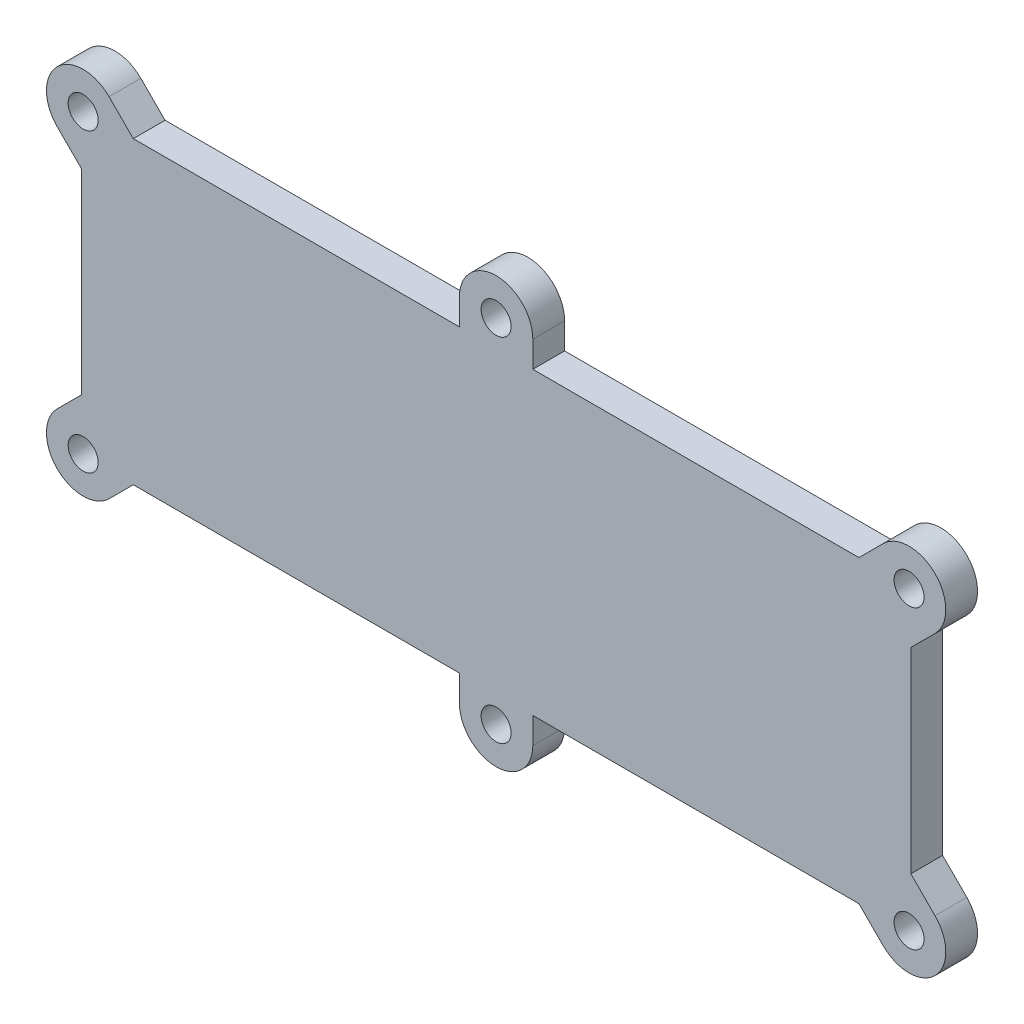
ISO-10303-21;
HEADER;
FILE_DESCRIPTION(('STEP AP214'),'2;1');
FILE_NAME('part.step','',(''),(''),'','','');
FILE_SCHEMA(('AUTOMOTIVE_DESIGN { 1 0 10303 214 1 1 1 1 }'));
ENDSEC;
DATA;
#1=APPLICATION_CONTEXT('core data for automotive mechanical design processes');
#2=APPLICATION_PROTOCOL_DEFINITION('international standard','automotive_design',2000,#1);
#3=PRODUCT_CONTEXT('',#1,'mechanical');
#4=PRODUCT('Part','Part','',(#3));
#5=PRODUCT_RELATED_PRODUCT_CATEGORY('part','',(#4));
#6=PRODUCT_DEFINITION_FORMATION('','',#4);
#7=PRODUCT_DEFINITION_CONTEXT('part definition',#1,'design');
#8=PRODUCT_DEFINITION('design','',#6,#7);
#9=PRODUCT_DEFINITION_SHAPE('','',#8);
#10=(LENGTH_UNIT() NAMED_UNIT(*) SI_UNIT(.MILLI.,.METRE.));
#11=(NAMED_UNIT(*) PLANE_ANGLE_UNIT() SI_UNIT($,.RADIAN.));
#12=(NAMED_UNIT(*) SI_UNIT($,.STERADIAN.) SOLID_ANGLE_UNIT());
#13=UNCERTAINTY_MEASURE_WITH_UNIT(LENGTH_MEASURE(1.E-05),#10,'distance_accuracy_value','');
#14=(GEOMETRIC_REPRESENTATION_CONTEXT(3) GLOBAL_UNCERTAINTY_ASSIGNED_CONTEXT((#13)) GLOBAL_UNIT_ASSIGNED_CONTEXT((#10,
#11,#12)) REPRESENTATION_CONTEXT('',''));
#15=CARTESIAN_POINT('',(0.,0.,0.));
#16=DIRECTION('',(0.,0.,1.));
#17=DIRECTION('',(1.,0.,0.));
#18=AXIS2_PLACEMENT_3D('',#15,#16,#17);
#19=CARTESIAN_POINT('',(169.737535958449,-39.7250258147976,4.7625));
#20=DIRECTION('',(0.707106781186552,-0.707106781186543,0.));
#21=DIRECTION('',(0.707106781186543,0.707106781186552,0.));
#22=AXIS2_PLACEMENT_3D('',#19,#20,#21);
#23=PLANE('',#22);
#24=DIRECTION('',(-0.707106781186543,-0.707106781186552,0.));
#25=VECTOR('',#24,1.);
#26=CARTESIAN_POINT('',(169.737535958449,-39.7250258147976,0.));
#27=LINE('',#26,#25);
#28=CARTESIAN_POINT('',(169.737535958449,-39.7250258147976,0.));
#29=VERTEX_POINT('',#28);
#30=CARTESIAN_POINT('',(166.110631802736,-43.3519299705105,0.));
#31=VERTEX_POINT('',#30);
#32=EDGE_CURVE('E230',#29,#31,#27,.T.);
#33=ORIENTED_EDGE('',*,*,#32,.T.);
#34=DIRECTION('',(0.,0.,-1.));
#35=VECTOR('',#34,1.);
#36=CARTESIAN_POINT('',(166.110631802736,-43.3519299705105,4.7625));
#37=LINE('',#36,#35);
#38=CARTESIAN_POINT('',(166.110631802736,-43.3519299705105,4.7625));
#39=VERTEX_POINT('',#38);
#40=EDGE_CURVE('E11',#39,#31,#37,.T.);
#41=ORIENTED_EDGE('',*,*,#40,.F.);
#42=DIRECTION('',(-0.707106781186543,-0.707106781186552,0.));
#43=VECTOR('',#42,1.);
#44=CARTESIAN_POINT('',(169.737535958449,-39.7250258147976,4.7625));
#45=LINE('',#44,#43);
#46=CARTESIAN_POINT('',(169.737535958449,-39.7250258147976,4.7625));
#47=VERTEX_POINT('',#46);
#48=EDGE_CURVE('E277',#47,#39,#45,.T.);
#49=ORIENTED_EDGE('',*,*,#48,.F.);
#50=DIRECTION('',(0.,0.,-1.));
#51=VECTOR('',#50,1.);
#52=CARTESIAN_POINT('',(169.737535958449,-39.7250258147976,4.7625));
#53=LINE('',#52,#51);
#54=EDGE_CURVE('E226',#47,#29,#53,.T.);
#55=ORIENTED_EDGE('',*,*,#54,.T.);
#56=EDGE_LOOP('',(#33,#41,#49,#55));
#57=FACE_BOUND('',#56,.T.);
#58=ADVANCED_FACE('F38',(#57),#23,.F.);
#59=CARTESIAN_POINT('',(166.110631802736,-43.3519299705105,4.7625));
#60=DIRECTION('',(0.,-1.,0.));
#61=DIRECTION('',(0.,0.,-1.));
#62=AXIS2_PLACEMENT_3D('',#59,#60,#61);
#63=PLANE('',#62);
#64=DIRECTION('',(-1.,0.,0.));
#65=VECTOR('',#64,1.);
#66=CARTESIAN_POINT('',(166.110631802736,-43.3519299705105,0.));
#67=LINE('',#66,#65);
#68=CARTESIAN_POINT('',(117.238806395788,-43.3519299705105,0.));
#69=VERTEX_POINT('',#68);
#70=EDGE_CURVE('E233',#31,#69,#67,.T.);
#71=ORIENTED_EDGE('',*,*,#70,.T.);
#72=DIRECTION('',(0.,0.,-1.));
#73=VECTOR('',#72,1.);
#74=CARTESIAN_POINT('',(117.238806395788,-43.3519299705105,4.7625));
#75=LINE('',#74,#73);
#76=CARTESIAN_POINT('',(117.238806395788,-43.3519299705105,4.7625));
#77=VERTEX_POINT('',#76);
#78=EDGE_CURVE('E46',#77,#69,#75,.T.);
#79=ORIENTED_EDGE('',*,*,#78,.F.);
#80=DIRECTION('',(-1.,0.,0.));
#81=VECTOR('',#80,1.);
#82=CARTESIAN_POINT('',(166.110631802736,-43.3519299705105,4.7625));
#83=LINE('',#82,#81);
#84=EDGE_CURVE('E145',#39,#77,#83,.T.);
#85=ORIENTED_EDGE('',*,*,#84,.F.);
#86=ORIENTED_EDGE('',*,*,#40,.T.);
#87=EDGE_LOOP('',(#71,#79,#85,#86));
#88=FACE_BOUND('',#87,.T.);
#89=ADVANCED_FACE('F416',(#88),#63,.F.);
#90=CARTESIAN_POINT('',(117.238806395788,-43.3519299705105,4.7625));
#91=DIRECTION('',(-1.,0.,0.));
#92=DIRECTION('',(0.,0.,1.));
#93=AXIS2_PLACEMENT_3D('',#90,#91,#92);
#94=PLANE('',#93);
#95=DIRECTION('',(0.,1.,0.));
#96=VECTOR('',#95,1.);
#97=CARTESIAN_POINT('',(117.238806395788,-43.3519299705105,0.));
#98=LINE('',#97,#96);
#99=CARTESIAN_POINT('',(117.238806395788,-39.4422299705105,0.));
#100=VERTEX_POINT('',#99);
#101=EDGE_CURVE('E236',#69,#100,#98,.T.);
#102=ORIENTED_EDGE('',*,*,#101,.T.);
#103=DIRECTION('',(0.,0.,-1.));
#104=VECTOR('',#103,1.);
#105=CARTESIAN_POINT('',(117.238806395788,-39.4422299705105,4.7625));
#106=LINE('',#105,#104);
#107=CARTESIAN_POINT('',(117.238806395788,-39.4422299705105,4.7625));
#108=VERTEX_POINT('',#107);
#109=EDGE_CURVE('E332',#108,#100,#106,.T.);
#110=ORIENTED_EDGE('',*,*,#109,.F.);
#111=DIRECTION('',(0.,1.,0.));
#112=VECTOR('',#111,1.);
#113=CARTESIAN_POINT('',(117.238806395788,-43.3519299705105,4.7625));
#114=LINE('',#113,#112);
#115=EDGE_CURVE('E340',#77,#108,#114,.T.);
#116=ORIENTED_EDGE('',*,*,#115,.F.);
#117=ORIENTED_EDGE('',*,*,#78,.T.);
#118=EDGE_LOOP('',(#102,#110,#116,#117));
#119=FACE_BOUND('',#118,.T.);
#120=ADVANCED_FACE('F338',(#119),#94,.F.);
#121=CARTESIAN_POINT('',(111.738806395788,-39.4422299705105,4.7625));
#122=DIRECTION('',(0.,0.,-1.));
#123=DIRECTION('',(-1.,0.,0.));
#124=AXIS2_PLACEMENT_3D('',#121,#122,#123);
#125=CYLINDRICAL_SURFACE('',#124,5.50000000000001);
#126=CARTESIAN_POINT('',(111.738806395788,-39.4422299705105,0.));
#127=DIRECTION('',(0.,0.,1.));
#128=DIRECTION('',(1.,0.,0.));
#129=AXIS2_PLACEMENT_3D('',#126,#127,#128);
#130=CIRCLE('',#129,5.50000000000001);
#131=CARTESIAN_POINT('',(106.238806395788,-39.4422299705105,0.));
#132=VERTEX_POINT('',#131);
#133=EDGE_CURVE('E238',#100,#132,#130,.T.);
#134=ORIENTED_EDGE('',*,*,#133,.T.);
#135=DIRECTION('',(0.,0.,-1.));
#136=VECTOR('',#135,1.);
#137=CARTESIAN_POINT('',(106.238806395788,-39.4422299705105,4.7625));
#138=LINE('',#137,#136);
#139=CARTESIAN_POINT('',(106.238806395788,-39.4422299705105,4.7625));
#140=VERTEX_POINT('',#139);
#141=EDGE_CURVE('E329',#140,#132,#138,.T.);
#142=ORIENTED_EDGE('',*,*,#141,.F.);
#143=CARTESIAN_POINT('',(111.738806395788,-39.4422299705105,4.7625));
#144=DIRECTION('',(0.,0.,1.));
#145=DIRECTION('',(1.,0.,0.));
#146=AXIS2_PLACEMENT_3D('',#143,#144,#145);
#147=CIRCLE('',#146,5.50000000000001);
#148=EDGE_CURVE('E358',#108,#140,#147,.T.);
#149=ORIENTED_EDGE('',*,*,#148,.F.);
#150=ORIENTED_EDGE('',*,*,#109,.T.);
#151=EDGE_LOOP('',(#134,#142,#149,#150));
#152=FACE_BOUND('',#151,.T.);
#153=ADVANCED_FACE('F349',(#152),#125,.T.);
#154=CARTESIAN_POINT('',(106.238806395788,-39.4422299705105,4.7625));
#155=DIRECTION('',(1.,0.,0.));
#156=DIRECTION('',(0.,0.,-1.));
#157=AXIS2_PLACEMENT_3D('',#154,#155,#156);
#158=PLANE('',#157);
#159=DIRECTION('',(0.,-1.,0.));
#160=VECTOR('',#159,1.);
#161=CARTESIAN_POINT('',(106.238806395788,-39.4422299705105,0.));
#162=LINE('',#161,#160);
#163=CARTESIAN_POINT('',(106.238806395788,-43.3519299705105,0.));
#164=VERTEX_POINT('',#163);
#165=EDGE_CURVE('E240',#132,#164,#162,.T.);
#166=ORIENTED_EDGE('',*,*,#165,.T.);
#167=DIRECTION('',(0.,0.,-1.));
#168=VECTOR('',#167,1.);
#169=CARTESIAN_POINT('',(106.238806395788,-43.3519299705105,4.7625));
#170=LINE('',#169,#168);
#171=CARTESIAN_POINT('',(106.238806395788,-43.3519299705105,4.7625));
#172=VERTEX_POINT('',#171);
#173=EDGE_CURVE('E326',#172,#164,#170,.T.);
#174=ORIENTED_EDGE('',*,*,#173,.F.);
#175=DIRECTION('',(0.,-1.,0.));
#176=VECTOR('',#175,1.);
#177=CARTESIAN_POINT('',(106.238806395788,-39.4422299705105,4.7625));
#178=LINE('',#177,#176);
#179=EDGE_CURVE('E355',#140,#172,#178,.T.);
#180=ORIENTED_EDGE('',*,*,#179,.F.);
#181=ORIENTED_EDGE('',*,*,#141,.T.);
#182=EDGE_LOOP('',(#166,#174,#180,#181));
#183=FACE_BOUND('',#182,.T.);
#184=ADVANCED_FACE('F353',(#183),#158,.F.);
#185=CARTESIAN_POINT('',(106.238806395788,-43.3519299705105,4.7625));
#186=DIRECTION('',(0.,-1.,0.));
#187=DIRECTION('',(0.,0.,-1.));
#188=AXIS2_PLACEMENT_3D('',#185,#186,#187);
#189=PLANE('',#188);
#190=DIRECTION('',(-1.,0.,0.));
#191=VECTOR('',#190,1.);
#192=CARTESIAN_POINT('',(106.238806395788,-43.3519299705105,0.));
#193=LINE('',#192,#191);
#194=CARTESIAN_POINT('',(57.3669809888401,-43.3519299705105,0.));
#195=VERTEX_POINT('',#194);
#196=EDGE_CURVE('E242',#164,#195,#193,.T.);
#197=ORIENTED_EDGE('',*,*,#196,.T.);
#198=DIRECTION('',(0.,0.,-1.));
#199=VECTOR('',#198,1.);
#200=CARTESIAN_POINT('',(57.3669809888401,-43.3519299705105,4.7625));
#201=LINE('',#200,#199);
#202=CARTESIAN_POINT('',(57.3669809888401,-43.3519299705105,4.7625));
#203=VERTEX_POINT('',#202);
#204=EDGE_CURVE('E323',#203,#195,#201,.T.);
#205=ORIENTED_EDGE('',*,*,#204,.F.);
#206=DIRECTION('',(-1.,0.,0.));
#207=VECTOR('',#206,1.);
#208=CARTESIAN_POINT('',(106.238806395788,-43.3519299705105,4.7625));
#209=LINE('',#208,#207);
#210=EDGE_CURVE('E357',#172,#203,#209,.T.);
#211=ORIENTED_EDGE('',*,*,#210,.F.);
#212=ORIENTED_EDGE('',*,*,#173,.T.);
#213=EDGE_LOOP('',(#197,#205,#211,#212));
#214=FACE_BOUND('',#213,.T.);
#215=ADVANCED_FACE('F429',(#214),#189,.F.);
#216=CARTESIAN_POINT('',(57.3669809888401,-43.3519299705105,4.7625));
#217=DIRECTION('',(-0.707106781186548,-0.707106781186548,0.));
#218=DIRECTION('',(0.707106781186548,-0.707106781186548,0.));
#219=AXIS2_PLACEMENT_3D('',#216,#217,#218);
#220=PLANE('',#219);
#221=DIRECTION('',(-0.707106781186548,0.707106781186548,0.));
#222=VECTOR('',#221,1.);
#223=CARTESIAN_POINT('',(57.3669809888401,-43.3519299705105,0.));
#224=LINE('',#223,#222);
#225=CARTESIAN_POINT('',(53.7400768331272,-39.7250258147976,0.));
#226=VERTEX_POINT('',#225);
#227=EDGE_CURVE('E244',#195,#226,#224,.T.);
#228=ORIENTED_EDGE('',*,*,#227,.T.);
#229=DIRECTION('',(0.,0.,-1.));
#230=VECTOR('',#229,1.);
#231=CARTESIAN_POINT('',(53.7400768331272,-39.7250258147976,4.7625));
#232=LINE('',#231,#230);
#233=CARTESIAN_POINT('',(53.7400768331272,-39.7250258147976,4.7625));
#234=VERTEX_POINT('',#233);
#235=EDGE_CURVE('E320',#234,#226,#232,.T.);
#236=ORIENTED_EDGE('',*,*,#235,.F.);
#237=DIRECTION('',(-0.707106781186548,0.707106781186548,0.));
#238=VECTOR('',#237,1.);
#239=CARTESIAN_POINT('',(57.3669809888401,-43.3519299705105,4.7625));
#240=LINE('',#239,#238);
#241=EDGE_CURVE('E360',#203,#234,#240,.T.);
#242=ORIENTED_EDGE('',*,*,#241,.F.);
#243=ORIENTED_EDGE('',*,*,#204,.T.);
#244=EDGE_LOOP('',(#228,#236,#242,#243));
#245=FACE_BOUND('',#244,.T.);
#246=ADVANCED_FACE('F432',(#245),#220,.F.);
#247=CARTESIAN_POINT('',(49.8509895366012,-43.6141131113236,4.7625));
#248=DIRECTION('',(0.,0.,-1.));
#249=DIRECTION('',(-1.,0.,0.));
#250=AXIS2_PLACEMENT_3D('',#247,#248,#249);
#251=CYLINDRICAL_SURFACE('',#250,5.49999999999999);
#252=CARTESIAN_POINT('',(49.8509895366012,-43.6141131113236,0.));
#253=DIRECTION('',(0.,0.,1.));
#254=DIRECTION('',(1.,0.,0.));
#255=AXIS2_PLACEMENT_3D('',#252,#253,#254);
#256=CIRCLE('',#255,5.49999999999999);
#257=CARTESIAN_POINT('',(45.9619022400752,-47.5032004078496,0.));
#258=VERTEX_POINT('',#257);
#259=EDGE_CURVE('E246',#226,#258,#256,.T.);
#260=ORIENTED_EDGE('',*,*,#259,.T.);
#261=DIRECTION('',(0.,0.,-1.));
#262=VECTOR('',#261,1.);
#263=CARTESIAN_POINT('',(45.9619022400752,-47.5032004078496,4.7625));
#264=LINE('',#263,#262);
#265=CARTESIAN_POINT('',(45.9619022400752,-47.5032004078496,4.7625));
#266=VERTEX_POINT('',#265);
#267=EDGE_CURVE('E317',#266,#258,#264,.T.);
#268=ORIENTED_EDGE('',*,*,#267,.F.);
#269=CARTESIAN_POINT('',(49.8509895366012,-43.6141131113236,4.7625));
#270=DIRECTION('',(0.,0.,1.));
#271=DIRECTION('',(1.,0.,0.));
#272=AXIS2_PLACEMENT_3D('',#269,#270,#271);
#273=CIRCLE('',#272,5.49999999999999);
#274=EDGE_CURVE('E366',#234,#266,#273,.T.);
#275=ORIENTED_EDGE('',*,*,#274,.F.);
#276=ORIENTED_EDGE('',*,*,#235,.T.);
#277=EDGE_LOOP('',(#260,#268,#275,#276));
#278=FACE_BOUND('',#277,.T.);
#279=ADVANCED_FACE('F436',(#278),#251,.T.);
#280=CARTESIAN_POINT('',(45.9619022400752,-47.5032004078497,4.7625));
#281=DIRECTION('',(0.707106781186549,0.707106781186545,0.));
#282=DIRECTION('',(-0.707106781186546,0.70710678118655,0.));
#283=AXIS2_PLACEMENT_3D('',#280,#281,#282);
#284=PLANE('',#283);
#285=DIRECTION('',(0.707106781186545,-0.707106781186549,0.));
#286=VECTOR('',#285,1.);
#287=CARTESIAN_POINT('',(45.9619022400752,-47.5032004078497,0.));
#288=LINE('',#287,#286);
#289=CARTESIAN_POINT('',(49.588806395788,-51.1301045635625,0.));
#290=VERTEX_POINT('',#289);
#291=EDGE_CURVE('E248',#258,#290,#288,.T.);
#292=ORIENTED_EDGE('',*,*,#291,.T.);
#293=DIRECTION('',(0.,0.,-1.));
#294=VECTOR('',#293,1.);
#295=CARTESIAN_POINT('',(49.588806395788,-51.1301045635625,4.7625));
#296=LINE('',#295,#294);
#297=CARTESIAN_POINT('',(49.588806395788,-51.1301045635625,4.7625));
#298=VERTEX_POINT('',#297);
#299=EDGE_CURVE('E314',#298,#290,#296,.T.);
#300=ORIENTED_EDGE('',*,*,#299,.F.);
#301=DIRECTION('',(0.707106781186545,-0.707106781186549,0.));
#302=VECTOR('',#301,1.);
#303=CARTESIAN_POINT('',(45.9619022400752,-47.5032004078497,4.7625));
#304=LINE('',#303,#302);
#305=EDGE_CURVE('E368',#266,#298,#304,.T.);
#306=ORIENTED_EDGE('',*,*,#305,.F.);
#307=ORIENTED_EDGE('',*,*,#267,.T.);
#308=EDGE_LOOP('',(#292,#300,#306,#307));
#309=FACE_BOUND('',#308,.T.);
#310=ADVANCED_FACE('F440',(#309),#284,.F.);
#311=CARTESIAN_POINT('',(49.588806395788,-51.1301045635625,4.7625));
#312=DIRECTION('',(1.,0.,0.));
#313=DIRECTION('',(0.,0.,-1.));
#314=AXIS2_PLACEMENT_3D('',#311,#312,#313);
#315=PLANE('',#314);
#316=DIRECTION('',(0.,-1.,0.));
#317=VECTOR('',#316,1.);
#318=CARTESIAN_POINT('',(49.588806395788,-51.1301045635625,0.));
#319=LINE('',#318,#317);
#320=CARTESIAN_POINT('',(49.588806395788,-80.4987553774585,0.));
#321=VERTEX_POINT('',#320);
#322=EDGE_CURVE('E250',#290,#321,#319,.T.);
#323=ORIENTED_EDGE('',*,*,#322,.T.);
#324=DIRECTION('',(0.,0.,-1.));
#325=VECTOR('',#324,1.);
#326=CARTESIAN_POINT('',(49.588806395788,-80.4987553774585,4.7625));
#327=LINE('',#326,#325);
#328=CARTESIAN_POINT('',(49.588806395788,-80.4987553774585,4.7625));
#329=VERTEX_POINT('',#328);
#330=EDGE_CURVE('E311',#329,#321,#327,.T.);
#331=ORIENTED_EDGE('',*,*,#330,.F.);
#332=DIRECTION('',(0.,-1.,0.));
#333=VECTOR('',#332,1.);
#334=CARTESIAN_POINT('',(49.588806395788,-51.1301045635625,4.7625));
#335=LINE('',#334,#333);
#336=EDGE_CURVE('E370',#298,#329,#335,.T.);
#337=ORIENTED_EDGE('',*,*,#336,.F.);
#338=ORIENTED_EDGE('',*,*,#299,.T.);
#339=EDGE_LOOP('',(#323,#331,#337,#338));
#340=FACE_BOUND('',#339,.T.);
#341=ADVANCED_FACE('F444',(#340),#315,.F.);
#342=CARTESIAN_POINT('',(49.588806395788,-80.4987553774585,4.7625));
#343=DIRECTION('',(0.707106781186546,-0.707106781186549,0.));
#344=DIRECTION('',(0.707106781186549,0.707106781186546,0.));
#345=AXIS2_PLACEMENT_3D('',#342,#343,#344);
#346=PLANE('',#345);
#347=DIRECTION('',(-0.707106781186549,-0.707106781186546,0.));
#348=VECTOR('',#347,1.);
#349=CARTESIAN_POINT('',(49.588806395788,-80.4987553774585,0.));
#350=LINE('',#349,#348);
#351=CARTESIAN_POINT('',(45.9619022400752,-84.1256595331713,0.));
#352=VERTEX_POINT('',#351);
#353=EDGE_CURVE('E252',#321,#352,#350,.T.);
#354=ORIENTED_EDGE('',*,*,#353,.T.);
#355=DIRECTION('',(0.,0.,-1.));
#356=VECTOR('',#355,1.);
#357=CARTESIAN_POINT('',(45.9619022400752,-84.1256595331713,4.7625));
#358=LINE('',#357,#356);
#359=CARTESIAN_POINT('',(45.9619022400752,-84.1256595331713,4.7625));
#360=VERTEX_POINT('',#359);
#361=EDGE_CURVE('E308',#360,#352,#358,.T.);
#362=ORIENTED_EDGE('',*,*,#361,.F.);
#363=DIRECTION('',(-0.707106781186549,-0.707106781186546,0.));
#364=VECTOR('',#363,1.);
#365=CARTESIAN_POINT('',(49.588806395788,-80.4987553774585,4.7625));
#366=LINE('',#365,#364);
#367=EDGE_CURVE('E372',#329,#360,#366,.T.);
#368=ORIENTED_EDGE('',*,*,#367,.F.);
#369=ORIENTED_EDGE('',*,*,#330,.T.);
#370=EDGE_LOOP('',(#354,#362,#368,#369));
#371=FACE_BOUND('',#370,.T.);
#372=ADVANCED_FACE('F448',(#371),#346,.F.);
#373=CARTESIAN_POINT('',(49.8509895366012,-88.0147468296973,4.7625));
#374=DIRECTION('',(0.,0.,-1.));
#375=DIRECTION('',(-1.,0.,0.));
#376=AXIS2_PLACEMENT_3D('',#373,#374,#375);
#377=CYLINDRICAL_SURFACE('',#376,5.50000000000001);
#378=CARTESIAN_POINT('',(49.8509895366012,-88.0147468296973,0.));
#379=DIRECTION('',(0.,0.,1.));
#380=DIRECTION('',(1.,0.,0.));
#381=AXIS2_PLACEMENT_3D('',#378,#379,#380);
#382=CIRCLE('',#381,5.50000000000001);
#383=CARTESIAN_POINT('',(53.7400768331272,-91.9038341262234,0.));
#384=VERTEX_POINT('',#383);
#385=EDGE_CURVE('E254',#352,#384,#382,.T.);
#386=ORIENTED_EDGE('',*,*,#385,.T.);
#387=DIRECTION('',(0.,0.,-1.));
#388=VECTOR('',#387,1.);
#389=CARTESIAN_POINT('',(53.7400768331272,-91.9038341262234,4.7625));
#390=LINE('',#389,#388);
#391=CARTESIAN_POINT('',(53.7400768331272,-91.9038341262234,4.7625));
#392=VERTEX_POINT('',#391);
#393=EDGE_CURVE('E305',#392,#384,#390,.T.);
#394=ORIENTED_EDGE('',*,*,#393,.F.);
#395=CARTESIAN_POINT('',(49.8509895366012,-88.0147468296973,4.7625));
#396=DIRECTION('',(0.,0.,1.));
#397=DIRECTION('',(1.,0.,0.));
#398=AXIS2_PLACEMENT_3D('',#395,#396,#397);
#399=CIRCLE('',#398,5.50000000000001);
#400=EDGE_CURVE('E374',#360,#392,#399,.T.);
#401=ORIENTED_EDGE('',*,*,#400,.F.);
#402=ORIENTED_EDGE('',*,*,#361,.T.);
#403=EDGE_LOOP('',(#386,#394,#401,#402));
#404=FACE_BOUND('',#403,.T.);
#405=ADVANCED_FACE('F452',(#404),#377,.T.);
#406=CARTESIAN_POINT('',(53.7400768331272,-91.9038341262233,4.7625));
#407=DIRECTION('',(-0.707106781186549,0.707106781186545,0.));
#408=DIRECTION('',(-0.707106781186546,-0.70710678118655,0.));
#409=AXIS2_PLACEMENT_3D('',#406,#407,#408);
#410=PLANE('',#409);
#411=DIRECTION('',(0.707106781186545,0.707106781186549,0.));
#412=VECTOR('',#411,1.);
#413=CARTESIAN_POINT('',(53.7400768331272,-91.9038341262233,0.));
#414=LINE('',#413,#412);
#415=CARTESIAN_POINT('',(57.3669809888401,-88.2769299705105,0.));
#416=VERTEX_POINT('',#415);
#417=EDGE_CURVE('E256',#384,#416,#414,.T.);
#418=ORIENTED_EDGE('',*,*,#417,.T.);
#419=DIRECTION('',(0.,0.,-1.));
#420=VECTOR('',#419,1.);
#421=CARTESIAN_POINT('',(57.3669809888401,-88.2769299705105,4.7625));
#422=LINE('',#421,#420);
#423=CARTESIAN_POINT('',(57.3669809888401,-88.2769299705105,4.7625));
#424=VERTEX_POINT('',#423);
#425=EDGE_CURVE('E302',#424,#416,#422,.T.);
#426=ORIENTED_EDGE('',*,*,#425,.F.);
#427=DIRECTION('',(0.707106781186545,0.707106781186549,0.));
#428=VECTOR('',#427,1.);
#429=CARTESIAN_POINT('',(53.7400768331272,-91.9038341262233,4.7625));
#430=LINE('',#429,#428);
#431=EDGE_CURVE('E376',#392,#424,#430,.T.);
#432=ORIENTED_EDGE('',*,*,#431,.F.);
#433=ORIENTED_EDGE('',*,*,#393,.T.);
#434=EDGE_LOOP('',(#418,#426,#432,#433));
#435=FACE_BOUND('',#434,.T.);
#436=ADVANCED_FACE('F456',(#435),#410,.F.);
#437=CARTESIAN_POINT('',(57.3669809888401,-88.2769299705105,4.7625));
#438=DIRECTION('',(0.,1.,0.));
#439=DIRECTION('',(0.,0.,1.));
#440=AXIS2_PLACEMENT_3D('',#437,#438,#439);
#441=PLANE('',#440);
#442=DIRECTION('',(1.,0.,0.));
#443=VECTOR('',#442,1.);
#444=CARTESIAN_POINT('',(57.3669809888401,-88.2769299705105,0.));
#445=LINE('',#444,#443);
#446=CARTESIAN_POINT('',(106.238806395788,-88.2769299705105,0.));
#447=VERTEX_POINT('',#446);
#448=EDGE_CURVE('E258',#416,#447,#445,.T.);
#449=ORIENTED_EDGE('',*,*,#448,.T.);
#450=DIRECTION('',(0.,0.,-1.));
#451=VECTOR('',#450,1.);
#452=CARTESIAN_POINT('',(106.238806395788,-88.2769299705105,4.7625));
#453=LINE('',#452,#451);
#454=CARTESIAN_POINT('',(106.238806395788,-88.2769299705105,4.7625));
#455=VERTEX_POINT('',#454);
#456=EDGE_CURVE('E299',#455,#447,#453,.T.);
#457=ORIENTED_EDGE('',*,*,#456,.F.);
#458=DIRECTION('',(1.,0.,0.));
#459=VECTOR('',#458,1.);
#460=CARTESIAN_POINT('',(57.3669809888401,-88.2769299705105,4.7625));
#461=LINE('',#460,#459);
#462=EDGE_CURVE('E378',#424,#455,#461,.T.);
#463=ORIENTED_EDGE('',*,*,#462,.F.);
#464=ORIENTED_EDGE('',*,*,#425,.T.);
#465=EDGE_LOOP('',(#449,#457,#463,#464));
#466=FACE_BOUND('',#465,.T.);
#467=ADVANCED_FACE('F460',(#466),#441,.F.);
#468=CARTESIAN_POINT('',(106.238806395788,-88.2769299705105,4.7625));
#469=DIRECTION('',(1.,0.,0.));
#470=DIRECTION('',(0.,0.,-1.));
#471=AXIS2_PLACEMENT_3D('',#468,#469,#470);
#472=PLANE('',#471);
#473=DIRECTION('',(0.,-1.,0.));
#474=VECTOR('',#473,1.);
#475=CARTESIAN_POINT('',(106.238806395788,-88.2769299705105,0.));
#476=LINE('',#475,#474);
#477=CARTESIAN_POINT('',(106.238806395788,-92.1866299705105,0.));
#478=VERTEX_POINT('',#477);
#479=EDGE_CURVE('E260',#447,#478,#476,.T.);
#480=ORIENTED_EDGE('',*,*,#479,.T.);
#481=DIRECTION('',(0.,0.,-1.));
#482=VECTOR('',#481,1.);
#483=CARTESIAN_POINT('',(106.238806395788,-92.1866299705105,4.7625));
#484=LINE('',#483,#482);
#485=CARTESIAN_POINT('',(106.238806395788,-92.1866299705105,4.7625));
#486=VERTEX_POINT('',#485);
#487=EDGE_CURVE('E296',#486,#478,#484,.T.);
#488=ORIENTED_EDGE('',*,*,#487,.F.);
#489=DIRECTION('',(0.,-1.,0.));
#490=VECTOR('',#489,1.);
#491=CARTESIAN_POINT('',(106.238806395788,-88.2769299705105,4.7625));
#492=LINE('',#491,#490);
#493=EDGE_CURVE('E380',#455,#486,#492,.T.);
#494=ORIENTED_EDGE('',*,*,#493,.F.);
#495=ORIENTED_EDGE('',*,*,#456,.T.);
#496=EDGE_LOOP('',(#480,#488,#494,#495));
#497=FACE_BOUND('',#496,.T.);
#498=ADVANCED_FACE('F464',(#497),#472,.F.);
#499=CARTESIAN_POINT('',(111.738806395788,-92.1866299705105,4.7625));
#500=DIRECTION('',(0.,0.,-1.));
#501=DIRECTION('',(-1.,0.,0.));
#502=AXIS2_PLACEMENT_3D('',#499,#500,#501);
#503=CYLINDRICAL_SURFACE('',#502,5.50000000000001);
#504=CARTESIAN_POINT('',(111.738806395788,-92.1866299705105,0.));
#505=DIRECTION('',(0.,0.,1.));
#506=DIRECTION('',(1.,0.,0.));
#507=AXIS2_PLACEMENT_3D('',#504,#505,#506);
#508=CIRCLE('',#507,5.50000000000001);
#509=CARTESIAN_POINT('',(117.238806395788,-92.1866299705105,0.));
#510=VERTEX_POINT('',#509);
#511=EDGE_CURVE('E262',#478,#510,#508,.T.);
#512=ORIENTED_EDGE('',*,*,#511,.T.);
#513=DIRECTION('',(0.,0.,-1.));
#514=VECTOR('',#513,1.);
#515=CARTESIAN_POINT('',(117.238806395788,-92.1866299705105,4.7625));
#516=LINE('',#515,#514);
#517=CARTESIAN_POINT('',(117.238806395788,-92.1866299705105,4.7625));
#518=VERTEX_POINT('',#517);
#519=EDGE_CURVE('E293',#518,#510,#516,.T.);
#520=ORIENTED_EDGE('',*,*,#519,.F.);
#521=CARTESIAN_POINT('',(111.738806395788,-92.1866299705105,4.7625));
#522=DIRECTION('',(0.,0.,1.));
#523=DIRECTION('',(1.,0.,0.));
#524=AXIS2_PLACEMENT_3D('',#521,#522,#523);
#525=CIRCLE('',#524,5.50000000000001);
#526=EDGE_CURVE('E382',#486,#518,#525,.T.);
#527=ORIENTED_EDGE('',*,*,#526,.F.);
#528=ORIENTED_EDGE('',*,*,#487,.T.);
#529=EDGE_LOOP('',(#512,#520,#527,#528));
#530=FACE_BOUND('',#529,.T.);
#531=ADVANCED_FACE('F468',(#530),#503,.T.);
#532=CARTESIAN_POINT('',(117.238806395788,-92.1866299705105,4.7625));
#533=DIRECTION('',(-1.,0.,0.));
#534=DIRECTION('',(0.,0.,1.));
#535=AXIS2_PLACEMENT_3D('',#532,#533,#534);
#536=PLANE('',#535);
#537=DIRECTION('',(0.,1.,0.));
#538=VECTOR('',#537,1.);
#539=CARTESIAN_POINT('',(117.238806395788,-92.1866299705105,0.));
#540=LINE('',#539,#538);
#541=CARTESIAN_POINT('',(117.238806395788,-88.2769299705105,0.));
#542=VERTEX_POINT('',#541);
#543=EDGE_CURVE('E264',#510,#542,#540,.T.);
#544=ORIENTED_EDGE('',*,*,#543,.T.);
#545=DIRECTION('',(0.,0.,-1.));
#546=VECTOR('',#545,1.);
#547=CARTESIAN_POINT('',(117.238806395788,-88.2769299705105,4.7625));
#548=LINE('',#547,#546);
#549=CARTESIAN_POINT('',(117.238806395788,-88.2769299705105,4.7625));
#550=VERTEX_POINT('',#549);
#551=EDGE_CURVE('E290',#550,#542,#548,.T.);
#552=ORIENTED_EDGE('',*,*,#551,.F.);
#553=DIRECTION('',(0.,1.,0.));
#554=VECTOR('',#553,1.);
#555=CARTESIAN_POINT('',(117.238806395788,-92.1866299705105,4.7625));
#556=LINE('',#555,#554);
#557=EDGE_CURVE('E384',#518,#550,#556,.T.);
#558=ORIENTED_EDGE('',*,*,#557,.F.);
#559=ORIENTED_EDGE('',*,*,#519,.T.);
#560=EDGE_LOOP('',(#544,#552,#558,#559));
#561=FACE_BOUND('',#560,.T.);
#562=ADVANCED_FACE('F472',(#561),#536,.F.);
#563=CARTESIAN_POINT('',(117.238806395788,-88.2769299705105,4.7625));
#564=DIRECTION('',(0.,1.,0.));
#565=DIRECTION('',(0.,0.,1.));
#566=AXIS2_PLACEMENT_3D('',#563,#564,#565);
#567=PLANE('',#566);
#568=DIRECTION('',(1.,0.,0.));
#569=VECTOR('',#568,1.);
#570=CARTESIAN_POINT('',(117.238806395788,-88.2769299705105,0.));
#571=LINE('',#570,#569);
#572=CARTESIAN_POINT('',(166.110631802736,-88.2769299705105,0.));
#573=VERTEX_POINT('',#572);
#574=EDGE_CURVE('E266',#542,#573,#571,.T.);
#575=ORIENTED_EDGE('',*,*,#574,.T.);
#576=DIRECTION('',(0.,0.,-1.));
#577=VECTOR('',#576,1.);
#578=CARTESIAN_POINT('',(166.110631802736,-88.2769299705105,4.7625));
#579=LINE('',#578,#577);
#580=CARTESIAN_POINT('',(166.110631802736,-88.2769299705105,4.7625));
#581=VERTEX_POINT('',#580);
#582=EDGE_CURVE('E287',#581,#573,#579,.T.);
#583=ORIENTED_EDGE('',*,*,#582,.F.);
#584=DIRECTION('',(1.,0.,0.));
#585=VECTOR('',#584,1.);
#586=CARTESIAN_POINT('',(117.238806395788,-88.2769299705105,4.7625));
#587=LINE('',#586,#585);
#588=EDGE_CURVE('E386',#550,#581,#587,.T.);
#589=ORIENTED_EDGE('',*,*,#588,.F.);
#590=ORIENTED_EDGE('',*,*,#551,.T.);
#591=EDGE_LOOP('',(#575,#583,#589,#590));
#592=FACE_BOUND('',#591,.T.);
#593=ADVANCED_FACE('F476',(#592),#567,.F.);
#594=CARTESIAN_POINT('',(166.110631802736,-88.2769299705105,4.7625));
#595=DIRECTION('',(0.707106781186547,0.707106781186547,0.));
#596=DIRECTION('',(-0.707106781186548,0.707106781186548,0.));
#597=AXIS2_PLACEMENT_3D('',#594,#595,#596);
#598=PLANE('',#597);
#599=DIRECTION('',(0.707106781186547,-0.707106781186547,0.));
#600=VECTOR('',#599,1.);
#601=CARTESIAN_POINT('',(166.110631802736,-88.2769299705105,0.));
#602=LINE('',#601,#600);
#603=CARTESIAN_POINT('',(169.737535958449,-91.9038341262233,0.));
#604=VERTEX_POINT('',#603);
#605=EDGE_CURVE('E268',#573,#604,#602,.T.);
#606=ORIENTED_EDGE('',*,*,#605,.T.);
#607=DIRECTION('',(0.,0.,-1.));
#608=VECTOR('',#607,1.);
#609=CARTESIAN_POINT('',(169.737535958449,-91.9038341262233,4.7625));
#610=LINE('',#609,#608);
#611=CARTESIAN_POINT('',(169.737535958449,-91.9038341262233,4.7625));
#612=VERTEX_POINT('',#611);
#613=EDGE_CURVE('E284',#612,#604,#610,.T.);
#614=ORIENTED_EDGE('',*,*,#613,.F.);
#615=DIRECTION('',(0.707106781186547,-0.707106781186547,0.));
#616=VECTOR('',#615,1.);
#617=CARTESIAN_POINT('',(166.110631802736,-88.2769299705105,4.7625));
#618=LINE('',#617,#616);
#619=EDGE_CURVE('E388',#581,#612,#618,.T.);
#620=ORIENTED_EDGE('',*,*,#619,.F.);
#621=ORIENTED_EDGE('',*,*,#582,.T.);
#622=EDGE_LOOP('',(#606,#614,#620,#621));
#623=FACE_BOUND('',#622,.T.);
#624=ADVANCED_FACE('F480',(#623),#598,.F.);
#625=CARTESIAN_POINT('',(173.626623254975,-88.0147468296973,4.7625));
#626=DIRECTION('',(0.,0.,-1.));
#627=DIRECTION('',(-1.,0.,0.));
#628=AXIS2_PLACEMENT_3D('',#625,#626,#627);
#629=CYLINDRICAL_SURFACE('',#628,5.49999999999998);
#630=CARTESIAN_POINT('',(173.626623254975,-88.0147468296973,0.));
#631=DIRECTION('',(0.,0.,1.));
#632=DIRECTION('',(1.,0.,0.));
#633=AXIS2_PLACEMENT_3D('',#630,#631,#632);
#634=CIRCLE('',#633,5.49999999999998);
#635=CARTESIAN_POINT('',(177.515710551501,-84.1256595331713,0.));
#636=VERTEX_POINT('',#635);
#637=EDGE_CURVE('E270',#604,#636,#634,.T.);
#638=ORIENTED_EDGE('',*,*,#637,.T.);
#639=DIRECTION('',(0.,0.,-1.));
#640=VECTOR('',#639,1.);
#641=CARTESIAN_POINT('',(177.515710551501,-84.1256595331713,4.7625));
#642=LINE('',#641,#640);
#643=CARTESIAN_POINT('',(177.515710551501,-84.1256595331713,4.7625));
#644=VERTEX_POINT('',#643);
#645=EDGE_CURVE('E281',#644,#636,#642,.T.);
#646=ORIENTED_EDGE('',*,*,#645,.F.);
#647=CARTESIAN_POINT('',(173.626623254975,-88.0147468296973,4.7625));
#648=DIRECTION('',(0.,0.,1.));
#649=DIRECTION('',(1.,0.,0.));
#650=AXIS2_PLACEMENT_3D('',#647,#648,#649);
#651=CIRCLE('',#650,5.49999999999998);
#652=EDGE_CURVE('E390',#612,#644,#651,.T.);
#653=ORIENTED_EDGE('',*,*,#652,.F.);
#654=ORIENTED_EDGE('',*,*,#613,.T.);
#655=EDGE_LOOP('',(#638,#646,#653,#654));
#656=FACE_BOUND('',#655,.T.);
#657=ADVANCED_FACE('F396',(#656),#629,.T.);
#658=CARTESIAN_POINT('',(177.515710551501,-84.1256595331713,4.7625));
#659=DIRECTION('',(-0.707106781186552,-0.707106781186543,0.));
#660=DIRECTION('',(0.707106781186543,-0.707106781186552,0.));
#661=AXIS2_PLACEMENT_3D('',#658,#659,#660);
#662=PLANE('',#661);
#663=DIRECTION('',(-0.707106781186543,0.707106781186552,0.));
#664=VECTOR('',#663,1.);
#665=CARTESIAN_POINT('',(177.515710551501,-84.1256595331713,0.));
#666=LINE('',#665,#664);
#667=CARTESIAN_POINT('',(173.888806395788,-80.4987553774585,0.));
#668=VERTEX_POINT('',#667);
#669=EDGE_CURVE('E272',#636,#668,#666,.T.);
#670=ORIENTED_EDGE('',*,*,#669,.T.);
#671=DIRECTION('',(0.,0.,-1.));
#672=VECTOR('',#671,1.);
#673=CARTESIAN_POINT('',(173.888806395788,-80.4987553774585,4.7625));
#674=LINE('',#673,#672);
#675=CARTESIAN_POINT('',(173.888806395788,-80.4987553774585,4.7625));
#676=VERTEX_POINT('',#675);
#677=EDGE_CURVE('E221',#676,#668,#674,.T.);
#678=ORIENTED_EDGE('',*,*,#677,.F.);
#679=DIRECTION('',(-0.707106781186543,0.707106781186552,0.));
#680=VECTOR('',#679,1.);
#681=CARTESIAN_POINT('',(177.515710551501,-84.1256595331713,4.7625));
#682=LINE('',#681,#680);
#683=EDGE_CURVE('E212',#644,#676,#682,.T.);
#684=ORIENTED_EDGE('',*,*,#683,.F.);
#685=ORIENTED_EDGE('',*,*,#645,.T.);
#686=EDGE_LOOP('',(#670,#678,#684,#685));
#687=FACE_BOUND('',#686,.T.);
#688=ADVANCED_FACE('F400',(#687),#662,.F.);
#689=CARTESIAN_POINT('',(173.888806395788,-80.4987553774585,4.7625));
#690=DIRECTION('',(-1.,0.,0.));
#691=DIRECTION('',(0.,0.,1.));
#692=AXIS2_PLACEMENT_3D('',#689,#690,#691);
#693=PLANE('',#692);
#694=DIRECTION('',(0.,1.,0.));
#695=VECTOR('',#694,1.);
#696=CARTESIAN_POINT('',(173.888806395788,-80.4987553774585,0.));
#697=LINE('',#696,#695);
#698=CARTESIAN_POINT('',(173.888806395788,-51.1301045635625,0.));
#699=VERTEX_POINT('',#698);
#700=EDGE_CURVE('E220',#668,#699,#697,.T.);
#701=ORIENTED_EDGE('',*,*,#700,.T.);
#702=DIRECTION('',(0.,0.,-1.));
#703=VECTOR('',#702,1.);
#704=CARTESIAN_POINT('',(173.888806395788,-51.1301045635625,4.7625));
#705=LINE('',#704,#703);
#706=CARTESIAN_POINT('',(173.888806395788,-51.1301045635625,4.7625));
#707=VERTEX_POINT('',#706);
#708=EDGE_CURVE('E217',#707,#699,#705,.T.);
#709=ORIENTED_EDGE('',*,*,#708,.F.);
#710=DIRECTION('',(0.,1.,0.));
#711=VECTOR('',#710,1.);
#712=CARTESIAN_POINT('',(173.888806395788,-80.4987553774585,4.7625));
#713=LINE('',#712,#711);
#714=EDGE_CURVE('E206',#676,#707,#713,.T.);
#715=ORIENTED_EDGE('',*,*,#714,.F.);
#716=ORIENTED_EDGE('',*,*,#677,.T.);
#717=EDGE_LOOP('',(#701,#709,#715,#716));
#718=FACE_BOUND('',#717,.T.);
#719=ADVANCED_FACE('F218',(#718),#693,.F.);
#720=CARTESIAN_POINT('',(173.888806395788,-51.1301045635625,4.7625));
#721=DIRECTION('',(-0.707106781186547,0.707106781186548,0.));
#722=DIRECTION('',(-0.707106781186548,-0.707106781186547,0.));
#723=AXIS2_PLACEMENT_3D('',#720,#721,#722);
#724=PLANE('',#723);
#725=DIRECTION('',(0.707106781186548,0.707106781186547,0.));
#726=VECTOR('',#725,1.);
#727=CARTESIAN_POINT('',(173.888806395788,-51.1301045635625,0.));
#728=LINE('',#727,#726);
#729=CARTESIAN_POINT('',(177.515710551501,-47.5032004078497,0.));
#730=VERTEX_POINT('',#729);
#731=EDGE_CURVE('E131',#699,#730,#728,.T.);
#732=ORIENTED_EDGE('',*,*,#731,.T.);
#733=DIRECTION('',(0.,0.,-1.));
#734=VECTOR('',#733,1.);
#735=CARTESIAN_POINT('',(177.515710551501,-47.5032004078497,4.7625));
#736=LINE('',#735,#734);
#737=CARTESIAN_POINT('',(177.515710551501,-47.5032004078497,4.7625));
#738=VERTEX_POINT('',#737);
#739=EDGE_CURVE('E222',#738,#730,#736,.T.);
#740=ORIENTED_EDGE('',*,*,#739,.F.);
#741=DIRECTION('',(0.707106781186548,0.707106781186547,0.));
#742=VECTOR('',#741,1.);
#743=CARTESIAN_POINT('',(173.888806395788,-51.1301045635625,4.7625));
#744=LINE('',#743,#742);
#745=EDGE_CURVE('E210',#707,#738,#744,.T.);
#746=ORIENTED_EDGE('',*,*,#745,.F.);
#747=ORIENTED_EDGE('',*,*,#708,.T.);
#748=EDGE_LOOP('',(#732,#740,#746,#747));
#749=FACE_BOUND('',#748,.T.);
#750=ADVANCED_FACE('F224',(#749),#724,.F.);
#751=CARTESIAN_POINT('',(173.626623254975,-43.6141131113236,4.7625));
#752=DIRECTION('',(0.,0.,-1.));
#753=DIRECTION('',(-1.,0.,0.));
#754=AXIS2_PLACEMENT_3D('',#751,#752,#753);
#755=CYLINDRICAL_SURFACE('',#754,5.50000000000002);
#756=CARTESIAN_POINT('',(173.626623254975,-43.6141131113236,0.));
#757=DIRECTION('',(0.,0.,1.));
#758=DIRECTION('',(1.,0.,0.));
#759=AXIS2_PLACEMENT_3D('',#756,#757,#758);
#760=CIRCLE('',#759,5.50000000000002);
#761=EDGE_CURVE('E137',#730,#29,#760,.T.);
#762=ORIENTED_EDGE('',*,*,#761,.T.);
#763=ORIENTED_EDGE('',*,*,#54,.F.);
#764=CARTESIAN_POINT('',(173.626623254975,-43.6141131113236,4.7625));
#765=DIRECTION('',(0.,0.,1.));
#766=DIRECTION('',(1.,0.,0.));
#767=AXIS2_PLACEMENT_3D('',#764,#765,#766);
#768=CIRCLE('',#767,5.50000000000002);
#769=EDGE_CURVE('E54',#738,#47,#768,.T.);
#770=ORIENTED_EDGE('',*,*,#769,.F.);
#771=ORIENTED_EDGE('',*,*,#739,.T.);
#772=EDGE_LOOP('',(#762,#763,#770,#771));
#773=FACE_BOUND('',#772,.T.);
#774=ADVANCED_FACE('F404',(#773),#755,.T.);
#775=CARTESIAN_POINT('',(111.738806395788,-39.4422299705105,4.7625));
#776=DIRECTION('',(0.,0.,1.));
#777=DIRECTION('',(1.,0.,0.));
#778=AXIS2_PLACEMENT_3D('',#775,#776,#777);
#779=PLANE('',#778);
#780=CARTESIAN_POINT('',(111.738806395788,-39.4422299705105,4.7625));
#781=DIRECTION('',(0.,0.,1.));
#782=DIRECTION('',(1.,0.,0.));
#783=AXIS2_PLACEMENT_3D('',#780,#781,#782);
#784=CIRCLE('',#783,2.24999999999999);
#785=CARTESIAN_POINT('',(113.988806395788,-39.4422299705105,4.7625));
#786=VERTEX_POINT('',#785);
#787=EDGE_CURVE('E586',#786,#786,#784,.T.);
#788=ORIENTED_EDGE('',*,*,#787,.F.);
#789=EDGE_LOOP('',(#788));
#790=FACE_BOUND('',#789,.T.);
#791=CARTESIAN_POINT('',(173.626623254975,-43.6141131113236,4.7625));
#792=DIRECTION('',(0.,0.,1.));
#793=DIRECTION('',(1.,0.,0.));
#794=AXIS2_PLACEMENT_3D('',#791,#792,#793);
#795=CIRCLE('',#794,2.24999999999997);
#796=CARTESIAN_POINT('',(175.876623254975,-43.6141131113236,4.7625));
#797=VERTEX_POINT('',#796);
#798=EDGE_CURVE('E588',#797,#797,#795,.T.);
#799=ORIENTED_EDGE('',*,*,#798,.F.);
#800=EDGE_LOOP('',(#799));
#801=FACE_BOUND('',#800,.T.);
#802=CARTESIAN_POINT('',(173.626623254975,-88.0147468296973,4.7625));
#803=DIRECTION('',(0.,0.,1.));
#804=DIRECTION('',(1.,0.,0.));
#805=AXIS2_PLACEMENT_3D('',#802,#803,#804);
#806=CIRCLE('',#805,2.24999999999997);
#807=CARTESIAN_POINT('',(175.876623254975,-88.0147468296973,4.7625));
#808=VERTEX_POINT('',#807);
#809=EDGE_CURVE('E596',#808,#808,#806,.T.);
#810=ORIENTED_EDGE('',*,*,#809,.F.);
#811=EDGE_LOOP('',(#810));
#812=FACE_BOUND('',#811,.T.);
#813=CARTESIAN_POINT('',(111.738806395788,-92.1866299705105,4.7625));
#814=DIRECTION('',(0.,0.,1.));
#815=DIRECTION('',(1.,0.,0.));
#816=AXIS2_PLACEMENT_3D('',#813,#814,#815);
#817=CIRCLE('',#816,2.24999999999999);
#818=CARTESIAN_POINT('',(113.988806395788,-92.1866299705105,4.7625));
#819=VERTEX_POINT('',#818);
#820=EDGE_CURVE('E602',#819,#819,#817,.T.);
#821=ORIENTED_EDGE('',*,*,#820,.F.);
#822=EDGE_LOOP('',(#821));
#823=FACE_BOUND('',#822,.T.);
#824=CARTESIAN_POINT('',(49.8509895366012,-88.0147468296973,4.7625));
#825=DIRECTION('',(0.,0.,1.));
#826=DIRECTION('',(1.,0.,0.));
#827=AXIS2_PLACEMENT_3D('',#824,#825,#826);
#828=CIRCLE('',#827,2.24999999999999);
#829=CARTESIAN_POINT('',(52.1009895366012,-88.0147468296973,4.7625));
#830=VERTEX_POINT('',#829);
#831=EDGE_CURVE('E608',#830,#830,#828,.T.);
#832=ORIENTED_EDGE('',*,*,#831,.F.);
#833=EDGE_LOOP('',(#832));
#834=FACE_BOUND('',#833,.T.);
#835=CARTESIAN_POINT('',(49.8509895366012,-43.6141131113236,4.7625));
#836=DIRECTION('',(0.,0.,1.));
#837=DIRECTION('',(1.,0.,0.));
#838=AXIS2_PLACEMENT_3D('',#835,#836,#837);
#839=CIRCLE('',#838,2.24999999999999);
#840=CARTESIAN_POINT('',(52.1009895366012,-43.6141131113236,4.7625));
#841=VERTEX_POINT('',#840);
#842=EDGE_CURVE('E614',#841,#841,#839,.T.);
#843=ORIENTED_EDGE('',*,*,#842,.F.);
#844=EDGE_LOOP('',(#843));
#845=FACE_BOUND('',#844,.T.);
#846=ORIENTED_EDGE('',*,*,#48,.T.);
#847=ORIENTED_EDGE('',*,*,#84,.T.);
#848=ORIENTED_EDGE('',*,*,#115,.T.);
#849=ORIENTED_EDGE('',*,*,#148,.T.);
#850=ORIENTED_EDGE('',*,*,#179,.T.);
#851=ORIENTED_EDGE('',*,*,#210,.T.);
#852=ORIENTED_EDGE('',*,*,#241,.T.);
#853=ORIENTED_EDGE('',*,*,#274,.T.);
#854=ORIENTED_EDGE('',*,*,#305,.T.);
#855=ORIENTED_EDGE('',*,*,#336,.T.);
#856=ORIENTED_EDGE('',*,*,#367,.T.);
#857=ORIENTED_EDGE('',*,*,#400,.T.);
#858=ORIENTED_EDGE('',*,*,#431,.T.);
#859=ORIENTED_EDGE('',*,*,#462,.T.);
#860=ORIENTED_EDGE('',*,*,#493,.T.);
#861=ORIENTED_EDGE('',*,*,#526,.T.);
#862=ORIENTED_EDGE('',*,*,#557,.T.);
#863=ORIENTED_EDGE('',*,*,#588,.T.);
#864=ORIENTED_EDGE('',*,*,#619,.T.);
#865=ORIENTED_EDGE('',*,*,#652,.T.);
#866=ORIENTED_EDGE('',*,*,#683,.T.);
#867=ORIENTED_EDGE('',*,*,#714,.T.);
#868=ORIENTED_EDGE('',*,*,#745,.T.);
#869=ORIENTED_EDGE('',*,*,#769,.T.);
#870=EDGE_LOOP('',(#846,#847,#848,#849,#850,#851,#852,#853,#854,#855,#856,#857,#858,#859,#860,
#861,#862,#863,#864,#865,#866,#867,#868,#869));
#871=FACE_BOUND('',#870,.T.);
#872=ADVANCED_FACE('F208',(#790,#801,#812,#823,#834,#845,#871),#779,.T.);
#873=CARTESIAN_POINT('',(111.738806395788,-39.4422299705105,0.));
#874=DIRECTION('',(0.,0.,1.));
#875=DIRECTION('',(1.,0.,0.));
#876=AXIS2_PLACEMENT_3D('',#873,#874,#875);
#877=PLANE('',#876);
#878=CARTESIAN_POINT('',(111.738806395788,-39.4422299705105,0.));
#879=DIRECTION('',(0.,0.,1.));
#880=DIRECTION('',(1.,0.,0.));
#881=AXIS2_PLACEMENT_3D('',#878,#879,#880);
#882=CIRCLE('',#881,2.25);
#883=CARTESIAN_POINT('',(113.988806395788,-39.4422299705105,0.));
#884=VERTEX_POINT('',#883);
#885=EDGE_CURVE('E583',#884,#884,#882,.T.);
#886=ORIENTED_EDGE('',*,*,#885,.T.);
#887=EDGE_LOOP('',(#886));
#888=FACE_BOUND('',#887,.T.);
#889=CARTESIAN_POINT('',(173.626623254975,-43.6141131113236,0.));
#890=DIRECTION('',(0.,0.,1.));
#891=DIRECTION('',(1.,0.,0.));
#892=AXIS2_PLACEMENT_3D('',#889,#890,#891);
#893=CIRCLE('',#892,2.25);
#894=CARTESIAN_POINT('',(175.876623254975,-43.6141131113236,0.));
#895=VERTEX_POINT('',#894);
#896=EDGE_CURVE('E593',#895,#895,#893,.T.);
#897=ORIENTED_EDGE('',*,*,#896,.T.);
#898=EDGE_LOOP('',(#897));
#899=FACE_BOUND('',#898,.T.);
#900=CARTESIAN_POINT('',(173.626623254975,-88.0147468296973,0.));
#901=DIRECTION('',(0.,0.,1.));
#902=DIRECTION('',(1.,0.,0.));
#903=AXIS2_PLACEMENT_3D('',#900,#901,#902);
#904=CIRCLE('',#903,2.25);
#905=CARTESIAN_POINT('',(175.876623254975,-88.0147468296973,0.));
#906=VERTEX_POINT('',#905);
#907=EDGE_CURVE('E599',#906,#906,#904,.T.);
#908=ORIENTED_EDGE('',*,*,#907,.T.);
#909=EDGE_LOOP('',(#908));
#910=FACE_BOUND('',#909,.T.);
#911=CARTESIAN_POINT('',(111.738806395788,-92.1866299705105,0.));
#912=DIRECTION('',(0.,0.,1.));
#913=DIRECTION('',(1.,0.,0.));
#914=AXIS2_PLACEMENT_3D('',#911,#912,#913);
#915=CIRCLE('',#914,2.25);
#916=CARTESIAN_POINT('',(113.988806395788,-92.1866299705105,0.));
#917=VERTEX_POINT('',#916);
#918=EDGE_CURVE('E605',#917,#917,#915,.T.);
#919=ORIENTED_EDGE('',*,*,#918,.T.);
#920=EDGE_LOOP('',(#919));
#921=FACE_BOUND('',#920,.T.);
#922=CARTESIAN_POINT('',(49.8509895366012,-88.0147468296973,0.));
#923=DIRECTION('',(0.,0.,1.));
#924=DIRECTION('',(1.,0.,0.));
#925=AXIS2_PLACEMENT_3D('',#922,#923,#924);
#926=CIRCLE('',#925,2.25);
#927=CARTESIAN_POINT('',(52.1009895366012,-88.0147468296973,0.));
#928=VERTEX_POINT('',#927);
#929=EDGE_CURVE('E611',#928,#928,#926,.T.);
#930=ORIENTED_EDGE('',*,*,#929,.T.);
#931=EDGE_LOOP('',(#930));
#932=FACE_BOUND('',#931,.T.);
#933=CARTESIAN_POINT('',(49.8509895366012,-43.6141131113236,0.));
#934=DIRECTION('',(0.,0.,1.));
#935=DIRECTION('',(1.,0.,0.));
#936=AXIS2_PLACEMENT_3D('',#933,#934,#935);
#937=CIRCLE('',#936,2.25);
#938=CARTESIAN_POINT('',(52.1009895366012,-43.6141131113236,0.));
#939=VERTEX_POINT('',#938);
#940=EDGE_CURVE('E234',#939,#939,#937,.T.);
#941=ORIENTED_EDGE('',*,*,#940,.T.);
#942=EDGE_LOOP('',(#941));
#943=FACE_BOUND('',#942,.T.);
#944=ORIENTED_EDGE('',*,*,#32,.F.);
#945=ORIENTED_EDGE('',*,*,#761,.F.);
#946=ORIENTED_EDGE('',*,*,#731,.F.);
#947=ORIENTED_EDGE('',*,*,#700,.F.);
#948=ORIENTED_EDGE('',*,*,#669,.F.);
#949=ORIENTED_EDGE('',*,*,#637,.F.);
#950=ORIENTED_EDGE('',*,*,#605,.F.);
#951=ORIENTED_EDGE('',*,*,#574,.F.);
#952=ORIENTED_EDGE('',*,*,#543,.F.);
#953=ORIENTED_EDGE('',*,*,#511,.F.);
#954=ORIENTED_EDGE('',*,*,#479,.F.);
#955=ORIENTED_EDGE('',*,*,#448,.F.);
#956=ORIENTED_EDGE('',*,*,#417,.F.);
#957=ORIENTED_EDGE('',*,*,#385,.F.);
#958=ORIENTED_EDGE('',*,*,#353,.F.);
#959=ORIENTED_EDGE('',*,*,#322,.F.);
#960=ORIENTED_EDGE('',*,*,#291,.F.);
#961=ORIENTED_EDGE('',*,*,#259,.F.);
#962=ORIENTED_EDGE('',*,*,#227,.F.);
#963=ORIENTED_EDGE('',*,*,#196,.F.);
#964=ORIENTED_EDGE('',*,*,#165,.F.);
#965=ORIENTED_EDGE('',*,*,#133,.F.);
#966=ORIENTED_EDGE('',*,*,#101,.F.);
#967=ORIENTED_EDGE('',*,*,#70,.F.);
#968=EDGE_LOOP('',(#944,#945,#946,#947,#948,#949,#950,#951,#952,#953,#954,#955,#956,#957,#958,
#959,#960,#961,#962,#963,#964,#965,#966,#967));
#969=FACE_BOUND('',#968,.T.);
#970=ADVANCED_FACE('F344',(#888,#899,#910,#921,#932,#943,#969),#877,.F.);
#971=CARTESIAN_POINT('',(49.8509895366012,-43.6141131113236,4.7625));
#972=DIRECTION('',(0.,0.,1.));
#973=DIRECTION('',(1.,0.,0.));
#974=AXIS2_PLACEMENT_3D('',#971,#972,#973);
#975=CYLINDRICAL_SURFACE('',#974,2.25);
#976=ORIENTED_EDGE('',*,*,#940,.F.);
#977=EDGE_LOOP('',(#976));
#978=FACE_BOUND('',#977,.T.);
#979=ORIENTED_EDGE('',*,*,#842,.T.);
#980=EDGE_LOOP('',(#979));
#981=FACE_BOUND('',#980,.T.);
#982=ADVANCED_FACE('F517',(#978,#981),#975,.F.);
#983=CARTESIAN_POINT('',(49.8509895366012,-88.0147468296973,4.7625));
#984=DIRECTION('',(0.,0.,1.));
#985=DIRECTION('',(1.,0.,0.));
#986=AXIS2_PLACEMENT_3D('',#983,#984,#985);
#987=CYLINDRICAL_SURFACE('',#986,2.25);
#988=ORIENTED_EDGE('',*,*,#929,.F.);
#989=EDGE_LOOP('',(#988));
#990=FACE_BOUND('',#989,.T.);
#991=ORIENTED_EDGE('',*,*,#831,.T.);
#992=EDGE_LOOP('',(#991));
#993=FACE_BOUND('',#992,.T.);
#994=ADVANCED_FACE('F526',(#990,#993),#987,.F.);
#995=CARTESIAN_POINT('',(111.738806395788,-92.1866299705105,4.7625));
#996=DIRECTION('',(0.,0.,1.));
#997=DIRECTION('',(1.,0.,0.));
#998=AXIS2_PLACEMENT_3D('',#995,#996,#997);
#999=CYLINDRICAL_SURFACE('',#998,2.25);
#1000=ORIENTED_EDGE('',*,*,#918,.F.);
#1001=EDGE_LOOP('',(#1000));
#1002=FACE_BOUND('',#1001,.T.);
#1003=ORIENTED_EDGE('',*,*,#820,.T.);
#1004=EDGE_LOOP('',(#1003));
#1005=FACE_BOUND('',#1004,.T.);
#1006=ADVANCED_FACE('F536',(#1002,#1005),#999,.F.);
#1007=CARTESIAN_POINT('',(173.626623254975,-88.0147468296973,4.7625));
#1008=DIRECTION('',(0.,0.,1.));
#1009=DIRECTION('',(1.,0.,0.));
#1010=AXIS2_PLACEMENT_3D('',#1007,#1008,#1009);
#1011=CYLINDRICAL_SURFACE('',#1010,2.24999999999999);
#1012=ORIENTED_EDGE('',*,*,#907,.F.);
#1013=EDGE_LOOP('',(#1012));
#1014=FACE_BOUND('',#1013,.T.);
#1015=ORIENTED_EDGE('',*,*,#809,.T.);
#1016=EDGE_LOOP('',(#1015));
#1017=FACE_BOUND('',#1016,.T.);
#1018=ADVANCED_FACE('F546',(#1014,#1017),#1011,.F.);
#1019=CARTESIAN_POINT('',(173.626623254975,-43.6141131113236,4.7625));
#1020=DIRECTION('',(0.,0.,1.));
#1021=DIRECTION('',(1.,0.,0.));
#1022=AXIS2_PLACEMENT_3D('',#1019,#1020,#1021);
#1023=CYLINDRICAL_SURFACE('',#1022,2.24999999999999);
#1024=ORIENTED_EDGE('',*,*,#896,.F.);
#1025=EDGE_LOOP('',(#1024));
#1026=FACE_BOUND('',#1025,.T.);
#1027=ORIENTED_EDGE('',*,*,#798,.T.);
#1028=EDGE_LOOP('',(#1027));
#1029=FACE_BOUND('',#1028,.T.);
#1030=ADVANCED_FACE('F556',(#1026,#1029),#1023,.F.);
#1031=CARTESIAN_POINT('',(111.738806395788,-39.4422299705105,4.7625));
#1032=DIRECTION('',(0.,0.,1.));
#1033=DIRECTION('',(1.,0.,0.));
#1034=AXIS2_PLACEMENT_3D('',#1031,#1032,#1033);
#1035=CYLINDRICAL_SURFACE('',#1034,2.25);
#1036=ORIENTED_EDGE('',*,*,#885,.F.);
#1037=EDGE_LOOP('',(#1036));
#1038=FACE_BOUND('',#1037,.T.);
#1039=ORIENTED_EDGE('',*,*,#787,.T.);
#1040=EDGE_LOOP('',(#1039));
#1041=FACE_BOUND('',#1040,.T.);
#1042=ADVANCED_FACE('F566',(#1038,#1041),#1035,.F.);
#1043=CLOSED_SHELL('',(#58,#89,#120,#153,#184,#215,#246,#279,#310,#341,#372,#405,#436,#467,#498,
#531,#562,#593,#624,#657,#688,#719,#750,#774,#872,#970,#982,#994,#1006,#1018,#1030,#1042));
#1044=MANIFOLD_SOLID_BREP('B2',#1043);
#1045=ADVANCED_BREP_SHAPE_REPRESENTATION('',(#18,#1044),#14);
#1046=SHAPE_DEFINITION_REPRESENTATION(#9,#1045);
ENDSEC;
END-ISO-10303-21;
